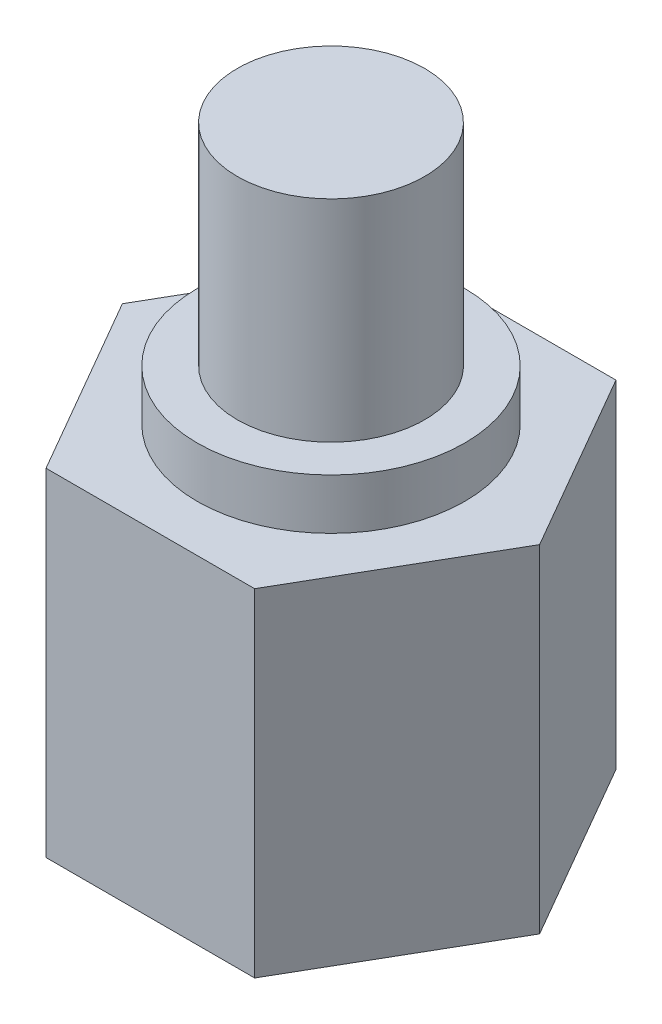
ISO-10303-21;
HEADER;
FILE_DESCRIPTION(('STEP AP214'),'2;1');
FILE_NAME('part.step','',(''),(''),'','','');
FILE_SCHEMA(('AUTOMOTIVE_DESIGN { 1 0 10303 214 1 1 1 1 }'));
ENDSEC;
DATA;
#1=APPLICATION_CONTEXT('core data for automotive mechanical design processes');
#2=APPLICATION_PROTOCOL_DEFINITION('international standard','automotive_design',2000,#1);
#3=PRODUCT_CONTEXT('',#1,'mechanical');
#4=PRODUCT('Part','Part','',(#3));
#5=PRODUCT_RELATED_PRODUCT_CATEGORY('part','',(#4));
#6=PRODUCT_DEFINITION_FORMATION('','',#4);
#7=PRODUCT_DEFINITION_CONTEXT('part definition',#1,'design');
#8=PRODUCT_DEFINITION('design','',#6,#7);
#9=PRODUCT_DEFINITION_SHAPE('','',#8);
#10=(LENGTH_UNIT() NAMED_UNIT(*) SI_UNIT(.MILLI.,.METRE.));
#11=(NAMED_UNIT(*) PLANE_ANGLE_UNIT() SI_UNIT($,.RADIAN.));
#12=(NAMED_UNIT(*) SI_UNIT($,.STERADIAN.) SOLID_ANGLE_UNIT());
#13=UNCERTAINTY_MEASURE_WITH_UNIT(LENGTH_MEASURE(1.E-05),#10,'distance_accuracy_value','');
#14=(GEOMETRIC_REPRESENTATION_CONTEXT(3) GLOBAL_UNCERTAINTY_ASSIGNED_CONTEXT((#13)) GLOBAL_UNIT_ASSIGNED_CONTEXT((#10,
#11,#12)) REPRESENTATION_CONTEXT('',''));
#15=CARTESIAN_POINT('',(0.,0.,0.));
#16=DIRECTION('',(0.,0.,1.));
#17=DIRECTION('',(1.,0.,0.));
#18=AXIS2_PLACEMENT_3D('',#15,#16,#17);
#19=CARTESIAN_POINT('',(0.,71.,0.));
#20=DIRECTION('',(0.,-1.,0.));
#21=DIRECTION('',(0.,0.,-1.));
#22=AXIS2_PLACEMENT_3D('',#19,#20,#21);
#23=CYLINDRICAL_SURFACE('',#22,11.1125);
#24=CARTESIAN_POINT('',(0.,71.,0.));
#25=DIRECTION('',(0.,1.,0.));
#26=DIRECTION('',(0.,0.,1.));
#27=AXIS2_PLACEMENT_3D('',#24,#25,#26);
#28=CIRCLE('',#27,11.1125);
#29=CARTESIAN_POINT('',(0.,71.,11.1125));
#30=VERTEX_POINT('',#29);
#31=EDGE_CURVE('E11',#30,#30,#28,.T.);
#32=ORIENTED_EDGE('',*,*,#31,.F.);
#33=EDGE_LOOP('',(#32));
#34=FACE_BOUND('',#33,.T.);
#35=CARTESIAN_POINT('',(0.,46.,0.));
#36=DIRECTION('',(0.,1.,0.));
#37=DIRECTION('',(0.,0.,1.));
#38=AXIS2_PLACEMENT_3D('',#35,#36,#37);
#39=CIRCLE('',#38,11.1125);
#40=CARTESIAN_POINT('',(0.,46.,11.1125));
#41=VERTEX_POINT('',#40);
#42=EDGE_CURVE('E45',#41,#41,#39,.T.);
#43=ORIENTED_EDGE('',*,*,#42,.T.);
#44=EDGE_LOOP('',(#43));
#45=FACE_BOUND('',#44,.T.);
#46=ADVANCED_FACE('F42',(#34,#45),#23,.T.);
#47=CARTESIAN_POINT('',(0.,71.,0.));
#48=DIRECTION('',(0.,1.,0.));
#49=DIRECTION('',(0.,0.,1.));
#50=AXIS2_PLACEMENT_3D('',#47,#48,#49);
#51=PLANE('',#50);
#52=ORIENTED_EDGE('',*,*,#31,.T.);
#53=EDGE_LOOP('',(#52));
#54=FACE_BOUND('',#53,.T.);
#55=ADVANCED_FACE('F57',(#54),#51,.T.);
#56=CARTESIAN_POINT('',(0.,46.,0.));
#57=DIRECTION('',(0.,1.,0.));
#58=DIRECTION('',(0.,0.,1.));
#59=AXIS2_PLACEMENT_3D('',#56,#57,#58);
#60=PLANE('',#59);
#61=ORIENTED_EDGE('',*,*,#42,.F.);
#62=EDGE_LOOP('',(#61));
#63=FACE_BOUND('',#62,.T.);
#64=ADVANCED_FACE('F55',(#63),#60,.F.);
#65=CLOSED_SHELL('',(#46,#55,#64));
#66=MANIFOLD_SOLID_BREP('B2',#65);
#67=CARTESIAN_POINT('',(0.,46.,0.));
#68=DIRECTION('',(0.,-1.,0.));
#69=DIRECTION('',(0.,0.,-1.));
#70=AXIS2_PLACEMENT_3D('',#67,#68,#69);
#71=CYLINDRICAL_SURFACE('',#70,15.875);
#72=CARTESIAN_POINT('',(0.,46.,0.));
#73=DIRECTION('',(0.,1.,0.));
#74=DIRECTION('',(0.,0.,1.));
#75=AXIS2_PLACEMENT_3D('',#72,#73,#74);
#76=CIRCLE('',#75,15.875);
#77=CARTESIAN_POINT('',(0.,46.,15.875));
#78=VERTEX_POINT('',#77);
#79=EDGE_CURVE('E41',#78,#78,#76,.T.);
#80=ORIENTED_EDGE('',*,*,#79,.F.);
#81=EDGE_LOOP('',(#80));
#82=FACE_BOUND('',#81,.T.);
#83=CARTESIAN_POINT('',(0.,40.,0.));
#84=DIRECTION('',(0.,1.,0.));
#85=DIRECTION('',(0.,0.,1.));
#86=AXIS2_PLACEMENT_3D('',#83,#84,#85);
#87=CIRCLE('',#86,15.875);
#88=CARTESIAN_POINT('',(0.,40.,15.875));
#89=VERTEX_POINT('',#88);
#90=EDGE_CURVE('E95',#89,#89,#87,.T.);
#91=ORIENTED_EDGE('',*,*,#90,.T.);
#92=EDGE_LOOP('',(#91));
#93=FACE_BOUND('',#92,.T.);
#94=ADVANCED_FACE('F92',(#82,#93),#71,.T.);
#95=CARTESIAN_POINT('',(0.,46.,0.));
#96=DIRECTION('',(0.,1.,0.));
#97=DIRECTION('',(0.,0.,1.));
#98=AXIS2_PLACEMENT_3D('',#95,#96,#97);
#99=PLANE('',#98);
#100=ORIENTED_EDGE('',*,*,#79,.T.);
#101=EDGE_LOOP('',(#100));
#102=FACE_BOUND('',#101,.T.);
#103=ADVANCED_FACE('F107',(#102),#99,.T.);
#104=CARTESIAN_POINT('',(0.,40.,0.));
#105=DIRECTION('',(0.,1.,0.));
#106=DIRECTION('',(0.,0.,1.));
#107=AXIS2_PLACEMENT_3D('',#104,#105,#106);
#108=PLANE('',#107);
#109=ORIENTED_EDGE('',*,*,#90,.F.);
#110=EDGE_LOOP('',(#109));
#111=FACE_BOUND('',#110,.T.);
#112=ADVANCED_FACE('F105',(#111),#108,.F.);
#113=CLOSED_SHELL('',(#94,#103,#112));
#114=MANIFOLD_SOLID_BREP('B6',#113);
#115=CARTESIAN_POINT('',(12.3750000000003,40.,21.4341287436647));
#116=DIRECTION('',(-0.866025403784442,0.,-0.499999999999995));
#117=DIRECTION('',(-0.499999999999995,0.,0.866025403784442));
#118=AXIS2_PLACEMENT_3D('',#115,#116,#117);
#119=PLANE('',#118);
#120=DIRECTION('',(0.499999999999995,0.,-0.866025403784442));
#121=VECTOR('',#120,1.);
#122=CARTESIAN_POINT('',(12.3750000000003,0.,21.4341287436647));
#123=LINE('',#122,#121);
#124=CARTESIAN_POINT('',(12.3750000000003,0.,21.4341287436647));
#125=VERTEX_POINT('',#124);
#126=CARTESIAN_POINT('',(24.75,0.,0.));
#127=VERTEX_POINT('',#126);
#128=EDGE_CURVE('E219',#125,#127,#123,.T.);
#129=ORIENTED_EDGE('',*,*,#128,.T.);
#130=DIRECTION('',(0.,-1.,0.));
#131=VECTOR('',#130,1.);
#132=CARTESIAN_POINT('',(24.75,40.,0.));
#133=LINE('',#132,#131);
#134=CARTESIAN_POINT('',(24.75,40.,0.));
#135=VERTEX_POINT('',#134);
#136=EDGE_CURVE('E90',#135,#127,#133,.T.);
#137=ORIENTED_EDGE('',*,*,#136,.F.);
#138=DIRECTION('',(0.499999999999995,0.,-0.866025403784442));
#139=VECTOR('',#138,1.);
#140=CARTESIAN_POINT('',(12.3750000000003,40.,21.4341287436647));
#141=LINE('',#140,#139);
#142=CARTESIAN_POINT('',(12.3750000000003,40.,21.4341287436647));
#143=VERTEX_POINT('',#142);
#144=EDGE_CURVE('E230',#143,#135,#141,.T.);
#145=ORIENTED_EDGE('',*,*,#144,.F.);
#146=DIRECTION('',(0.,-1.,0.));
#147=VECTOR('',#146,1.);
#148=CARTESIAN_POINT('',(12.3750000000003,40.,21.4341287436647));
#149=LINE('',#148,#147);
#150=EDGE_CURVE('E215',#143,#125,#149,.T.);
#151=ORIENTED_EDGE('',*,*,#150,.T.);
#152=EDGE_LOOP('',(#129,#137,#145,#151));
#153=FACE_BOUND('',#152,.T.);
#154=ADVANCED_FACE('F135',(#153),#119,.F.);
#155=CARTESIAN_POINT('',(24.75,40.,0.));
#156=DIRECTION('',(-0.866025403784438,0.,0.500000000000001));
#157=DIRECTION('',(0.500000000000001,0.,0.866025403784438));
#158=AXIS2_PLACEMENT_3D('',#155,#156,#157);
#159=PLANE('',#158);
#160=DIRECTION('',(-0.500000000000001,0.,-0.866025403784438));
#161=VECTOR('',#160,1.);
#162=CARTESIAN_POINT('',(24.75,0.,0.));
#163=LINE('',#162,#161);
#164=CARTESIAN_POINT('',(12.375,0.,-21.4341287436649));
#165=VERTEX_POINT('',#164);
#166=EDGE_CURVE('E222',#127,#165,#163,.T.);
#167=ORIENTED_EDGE('',*,*,#166,.T.);
#168=DIRECTION('',(0.,-1.,0.));
#169=VECTOR('',#168,1.);
#170=CARTESIAN_POINT('',(12.375,40.,-21.4341287436649));
#171=LINE('',#170,#169);
#172=CARTESIAN_POINT('',(12.375,40.,-21.4341287436649));
#173=VERTEX_POINT('',#172);
#174=EDGE_CURVE('E143',#173,#165,#171,.T.);
#175=ORIENTED_EDGE('',*,*,#174,.F.);
#176=DIRECTION('',(-0.500000000000001,0.,-0.866025403784438));
#177=VECTOR('',#176,1.);
#178=CARTESIAN_POINT('',(24.75,40.,0.));
#179=LINE('',#178,#177);
#180=EDGE_CURVE('E188',#135,#173,#179,.T.);
#181=ORIENTED_EDGE('',*,*,#180,.F.);
#182=ORIENTED_EDGE('',*,*,#136,.T.);
#183=EDGE_LOOP('',(#167,#175,#181,#182));
#184=FACE_BOUND('',#183,.T.);
#185=ADVANCED_FACE('F254',(#184),#159,.F.);
#186=CARTESIAN_POINT('',(12.375,40.,-21.4341287436649));
#187=DIRECTION('',(0.,0.,1.));
#188=DIRECTION('',(1.,0.,0.));
#189=AXIS2_PLACEMENT_3D('',#186,#187,#188);
#190=PLANE('',#189);
#191=DIRECTION('',(-1.,0.,0.));
#192=VECTOR('',#191,1.);
#193=CARTESIAN_POINT('',(12.375,0.,-21.4341287436649));
#194=LINE('',#193,#192);
#195=CARTESIAN_POINT('',(-12.3750000000001,0.,-21.4341287436648));
#196=VERTEX_POINT('',#195);
#197=EDGE_CURVE('E225',#165,#196,#194,.T.);
#198=ORIENTED_EDGE('',*,*,#197,.T.);
#199=DIRECTION('',(0.,-1.,0.));
#200=VECTOR('',#199,1.);
#201=CARTESIAN_POINT('',(-12.3750000000001,40.,-21.4341287436648));
#202=LINE('',#201,#200);
#203=CARTESIAN_POINT('',(-12.3750000000001,40.,-21.4341287436648));
#204=VERTEX_POINT('',#203);
#205=EDGE_CURVE('E210',#204,#196,#202,.T.);
#206=ORIENTED_EDGE('',*,*,#205,.F.);
#207=DIRECTION('',(-1.,0.,0.));
#208=VECTOR('',#207,1.);
#209=CARTESIAN_POINT('',(12.375,40.,-21.4341287436649));
#210=LINE('',#209,#208);
#211=EDGE_CURVE('E201',#173,#204,#210,.T.);
#212=ORIENTED_EDGE('',*,*,#211,.F.);
#213=ORIENTED_EDGE('',*,*,#174,.T.);
#214=EDGE_LOOP('',(#198,#206,#212,#213));
#215=FACE_BOUND('',#214,.T.);
#216=ADVANCED_FACE('F236',(#215),#190,.F.);
#217=CARTESIAN_POINT('',(-12.3750000000001,40.,-21.4341287436648));
#218=DIRECTION('',(0.866025403784442,0.,0.499999999999995));
#219=DIRECTION('',(0.499999999999995,0.,-0.866025403784442));
#220=AXIS2_PLACEMENT_3D('',#217,#218,#219);
#221=PLANE('',#220);
#222=DIRECTION('',(-0.499999999999995,0.,0.866025403784442));
#223=VECTOR('',#222,1.);
#224=CARTESIAN_POINT('',(-12.3750000000001,0.,-21.4341287436648));
#225=LINE('',#224,#223);
#226=CARTESIAN_POINT('',(-24.75,0.,1.72828326272735E-13));
#227=VERTEX_POINT('',#226);
#228=EDGE_CURVE('E209',#196,#227,#225,.T.);
#229=ORIENTED_EDGE('',*,*,#228,.T.);
#230=DIRECTION('',(0.,-1.,0.));
#231=VECTOR('',#230,1.);
#232=CARTESIAN_POINT('',(-24.75,40.,1.72828326272735E-13));
#233=LINE('',#232,#231);
#234=CARTESIAN_POINT('',(-24.75,40.,1.72828326272735E-13));
#235=VERTEX_POINT('',#234);
#236=EDGE_CURVE('E206',#235,#227,#233,.T.);
#237=ORIENTED_EDGE('',*,*,#236,.F.);
#238=DIRECTION('',(-0.499999999999995,0.,0.866025403784442));
#239=VECTOR('',#238,1.);
#240=CARTESIAN_POINT('',(-12.3750000000001,40.,-21.4341287436648));
#241=LINE('',#240,#239);
#242=EDGE_CURVE('E195',#204,#235,#241,.T.);
#243=ORIENTED_EDGE('',*,*,#242,.F.);
#244=ORIENTED_EDGE('',*,*,#205,.T.);
#245=EDGE_LOOP('',(#229,#237,#243,#244));
#246=FACE_BOUND('',#245,.T.);
#247=ADVANCED_FACE('F207',(#246),#221,.F.);
#248=CARTESIAN_POINT('',(-24.75,40.,1.72828326272735E-13));
#249=DIRECTION('',(0.866025403784435,0.,-0.500000000000007));
#250=DIRECTION('',(-0.500000000000007,0.,-0.866025403784435));
#251=AXIS2_PLACEMENT_3D('',#248,#249,#250);
#252=PLANE('',#251);
#253=DIRECTION('',(0.500000000000007,0.,0.866025403784435));
#254=VECTOR('',#253,1.);
#255=CARTESIAN_POINT('',(-24.75,0.,1.72828326272735E-13));
#256=LINE('',#255,#254);
#257=CARTESIAN_POINT('',(-12.3749999999998,0.,21.434128743665));
#258=VERTEX_POINT('',#257);
#259=EDGE_CURVE('E174',#227,#258,#256,.T.);
#260=ORIENTED_EDGE('',*,*,#259,.T.);
#261=DIRECTION('',(0.,-1.,0.));
#262=VECTOR('',#261,1.);
#263=CARTESIAN_POINT('',(-12.3749999999998,40.,21.434128743665));
#264=LINE('',#263,#262);
#265=CARTESIAN_POINT('',(-12.3749999999998,40.,21.434128743665));
#266=VERTEX_POINT('',#265);
#267=EDGE_CURVE('E211',#266,#258,#264,.T.);
#268=ORIENTED_EDGE('',*,*,#267,.F.);
#269=DIRECTION('',(0.500000000000007,0.,0.866025403784435));
#270=VECTOR('',#269,1.);
#271=CARTESIAN_POINT('',(-24.75,40.,1.72828326272735E-13));
#272=LINE('',#271,#270);
#273=EDGE_CURVE('E199',#235,#266,#272,.T.);
#274=ORIENTED_EDGE('',*,*,#273,.F.);
#275=ORIENTED_EDGE('',*,*,#236,.T.);
#276=EDGE_LOOP('',(#260,#268,#274,#275));
#277=FACE_BOUND('',#276,.T.);
#278=ADVANCED_FACE('F213',(#277),#252,.F.);
#279=CARTESIAN_POINT('',(-12.3749999999998,40.,21.434128743665));
#280=DIRECTION('',(0.,0.,-1.));
#281=DIRECTION('',(-1.,0.,0.));
#282=AXIS2_PLACEMENT_3D('',#279,#280,#281);
#283=PLANE('',#282);
#284=DIRECTION('',(1.,0.,0.));
#285=VECTOR('',#284,1.);
#286=CARTESIAN_POINT('',(-12.3749999999998,0.,21.434128743665));
#287=LINE('',#286,#285);
#288=EDGE_CURVE('E180',#258,#125,#287,.T.);
#289=ORIENTED_EDGE('',*,*,#288,.T.);
#290=ORIENTED_EDGE('',*,*,#150,.F.);
#291=DIRECTION('',(1.,0.,0.));
#292=VECTOR('',#291,1.);
#293=CARTESIAN_POINT('',(-12.3749999999998,40.,21.434128743665));
#294=LINE('',#293,#292);
#295=EDGE_CURVE('E151',#266,#143,#294,.T.);
#296=ORIENTED_EDGE('',*,*,#295,.F.);
#297=ORIENTED_EDGE('',*,*,#267,.T.);
#298=EDGE_LOOP('',(#289,#290,#296,#297));
#299=FACE_BOUND('',#298,.T.);
#300=ADVANCED_FACE('F243',(#299),#283,.F.);
#301=CARTESIAN_POINT('',(0.,40.,0.));
#302=DIRECTION('',(0.,1.,0.));
#303=DIRECTION('',(0.,0.,1.));
#304=AXIS2_PLACEMENT_3D('',#301,#302,#303);
#305=PLANE('',#304);
#306=ORIENTED_EDGE('',*,*,#144,.T.);
#307=ORIENTED_EDGE('',*,*,#180,.T.);
#308=ORIENTED_EDGE('',*,*,#211,.T.);
#309=ORIENTED_EDGE('',*,*,#242,.T.);
#310=ORIENTED_EDGE('',*,*,#273,.T.);
#311=ORIENTED_EDGE('',*,*,#295,.T.);
#312=EDGE_LOOP('',(#306,#307,#308,#309,#310,#311));
#313=FACE_BOUND('',#312,.T.);
#314=ADVANCED_FACE('F197',(#313),#305,.T.);
#315=CARTESIAN_POINT('',(0.,0.,0.));
#316=DIRECTION('',(0.,1.,0.));
#317=DIRECTION('',(0.,0.,1.));
#318=AXIS2_PLACEMENT_3D('',#315,#316,#317);
#319=PLANE('',#318);
#320=CARTESIAN_POINT('',(0.,0.,0.));
#321=DIRECTION('',(0.,-1.,0.));
#322=DIRECTION('',(0.,0.,-1.));
#323=AXIS2_PLACEMENT_3D('',#320,#321,#322);
#324=CIRCLE('',#323,7.5);
#325=CARTESIAN_POINT('',(0.,0.,-7.5));
#326=VERTEX_POINT('',#325);
#327=EDGE_CURVE('E318',#326,#326,#324,.T.);
#328=ORIENTED_EDGE('',*,*,#327,.F.);
#329=EDGE_LOOP('',(#328));
#330=FACE_BOUND('',#329,.T.);
#331=ORIENTED_EDGE('',*,*,#128,.F.);
#332=ORIENTED_EDGE('',*,*,#288,.F.);
#333=ORIENTED_EDGE('',*,*,#259,.F.);
#334=ORIENTED_EDGE('',*,*,#228,.F.);
#335=ORIENTED_EDGE('',*,*,#197,.F.);
#336=ORIENTED_EDGE('',*,*,#166,.F.);
#337=EDGE_LOOP('',(#331,#332,#333,#334,#335,#336));
#338=FACE_BOUND('',#337,.T.);
#339=ADVANCED_FACE('F239',(#330,#338),#319,.F.);
#340=CARTESIAN_POINT('',(0.,25.,0.));
#341=DIRECTION('',(0.,-1.,0.));
#342=DIRECTION('',(0.,0.,-1.));
#343=AXIS2_PLACEMENT_3D('',#340,#341,#342);
#344=CYLINDRICAL_SURFACE('',#343,7.5);
#345=CARTESIAN_POINT('',(0.,25.,0.));
#346=DIRECTION('',(0.,-1.,0.));
#347=DIRECTION('',(0.,0.,-1.));
#348=AXIS2_PLACEMENT_3D('',#345,#346,#347);
#349=CIRCLE('',#348,7.5);
#350=CARTESIAN_POINT('',(0.,25.,-7.5));
#351=VERTEX_POINT('',#350);
#352=EDGE_CURVE('E223',#351,#351,#349,.T.);
#353=ORIENTED_EDGE('',*,*,#352,.F.);
#354=EDGE_LOOP('',(#353));
#355=FACE_BOUND('',#354,.T.);
#356=ORIENTED_EDGE('',*,*,#327,.T.);
#357=EDGE_LOOP('',(#356));
#358=FACE_BOUND('',#357,.T.);
#359=ADVANCED_FACE('F293',(#355,#358),#344,.F.);
#360=CARTESIAN_POINT('',(0.,25.,0.));
#361=DIRECTION('',(0.,-1.,0.));
#362=DIRECTION('',(0.,0.,-1.));
#363=AXIS2_PLACEMENT_3D('',#360,#361,#362);
#364=PLANE('',#363);
#365=ORIENTED_EDGE('',*,*,#352,.T.);
#366=EDGE_LOOP('',(#365));
#367=FACE_BOUND('',#366,.T.);
#368=ADVANCED_FACE('F302',(#367),#364,.T.);
#369=CLOSED_SHELL('',(#154,#185,#216,#247,#278,#300,#314,#339,#359,#368));
#370=MANIFOLD_SOLID_BREP('B36',#369);
#371=ADVANCED_BREP_SHAPE_REPRESENTATION('',(#18,#66,#114,#370),#14);
#372=SHAPE_DEFINITION_REPRESENTATION(#9,#371);
ENDSEC;
END-ISO-10303-21;
